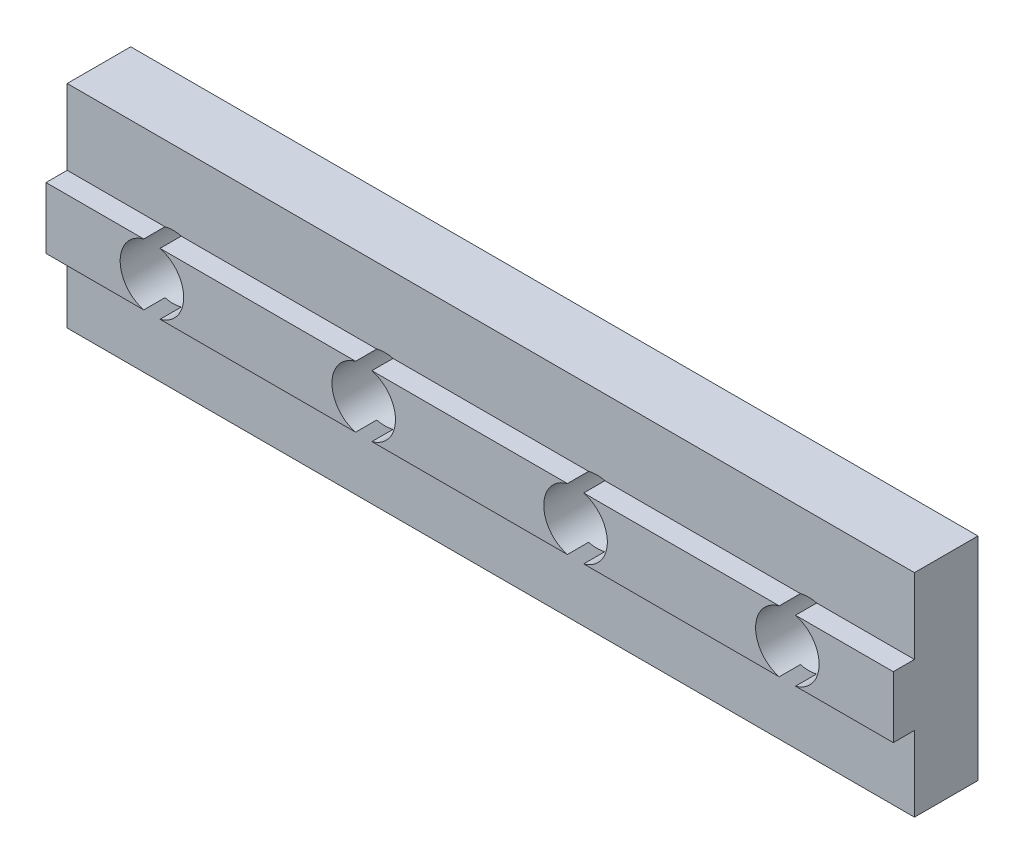
ISO-10303-21;
HEADER;
FILE_DESCRIPTION(('STEP AP214'),'2;1');
FILE_NAME('part.step','',(''),(''),'','','');
FILE_SCHEMA(('AUTOMOTIVE_DESIGN { 1 0 10303 214 1 1 1 1 }'));
ENDSEC;
DATA;
#1=APPLICATION_CONTEXT('core data for automotive mechanical design processes');
#2=APPLICATION_PROTOCOL_DEFINITION('international standard','automotive_design',2000,#1);
#3=PRODUCT_CONTEXT('',#1,'mechanical');
#4=PRODUCT('Part','Part','',(#3));
#5=PRODUCT_RELATED_PRODUCT_CATEGORY('part','',(#4));
#6=PRODUCT_DEFINITION_FORMATION('','',#4);
#7=PRODUCT_DEFINITION_CONTEXT('part definition',#1,'design');
#8=PRODUCT_DEFINITION('design','',#6,#7);
#9=PRODUCT_DEFINITION_SHAPE('','',#8);
#10=(LENGTH_UNIT() NAMED_UNIT(*) SI_UNIT(.MILLI.,.METRE.));
#11=(NAMED_UNIT(*) PLANE_ANGLE_UNIT() SI_UNIT($,.RADIAN.));
#12=(NAMED_UNIT(*) SI_UNIT($,.STERADIAN.) SOLID_ANGLE_UNIT());
#13=UNCERTAINTY_MEASURE_WITH_UNIT(LENGTH_MEASURE(1.E-05),#10,'distance_accuracy_value','');
#14=(GEOMETRIC_REPRESENTATION_CONTEXT(3) GLOBAL_UNCERTAINTY_ASSIGNED_CONTEXT((#13)) GLOBAL_UNIT_ASSIGNED_CONTEXT((#10,
#11,#12)) REPRESENTATION_CONTEXT('',''));
#15=CARTESIAN_POINT('',(0.,0.,0.));
#16=DIRECTION('',(0.,0.,1.));
#17=DIRECTION('',(1.,0.,0.));
#18=AXIS2_PLACEMENT_3D('',#15,#16,#17);
#19=CARTESIAN_POINT('',(40.,6.45000000000001,4.));
#20=DIRECTION('',(0.,-1.,0.));
#21=DIRECTION('',(1.,0.,0.));
#22=AXIS2_PLACEMENT_3D('',#19,#20,#21);
#23=PLANE('',#22);
#24=DIRECTION('',(-1.,0.,0.));
#25=VECTOR('',#24,1.);
#26=CARTESIAN_POINT('',(40.,6.45000000000001,4.));
#27=LINE('',#26,#25);
#28=CARTESIAN_POINT('',(14.6159427126066,6.45,4.));
#29=VERTEX_POINT('',#28);
#30=CARTESIAN_POINT('',(5.38405728739345,6.45,4.));
#31=VERTEX_POINT('',#30);
#32=EDGE_CURVE('E216',#29,#31,#27,.T.);
#33=ORIENTED_EDGE('',*,*,#32,.F.);
#34=DIRECTION('',(0.,0.,-1.));
#35=VECTOR('',#34,1.);
#36=CARTESIAN_POINT('',(14.6159427126066,6.45,4.));
#37=LINE('',#36,#35);
#38=CARTESIAN_POINT('',(14.6159427126066,6.45,3.));
#39=VERTEX_POINT('',#38);
#40=EDGE_CURVE('E257',#29,#39,#37,.T.);
#41=ORIENTED_EDGE('',*,*,#40,.T.);
#42=DIRECTION('',(-1.,0.,0.));
#43=VECTOR('',#42,1.);
#44=CARTESIAN_POINT('',(40.,6.45000000000001,3.));
#45=LINE('',#44,#43);
#46=CARTESIAN_POINT('',(5.38405728739345,6.45,3.));
#47=VERTEX_POINT('',#46);
#48=EDGE_CURVE('E304',#39,#47,#45,.T.);
#49=ORIENTED_EDGE('',*,*,#48,.T.);
#50=DIRECTION('',(0.,0.,-1.));
#51=VECTOR('',#50,1.);
#52=CARTESIAN_POINT('',(5.38405728739345,6.45,4.));
#53=LINE('',#52,#51);
#54=EDGE_CURVE('E200',#47,#31,#53,.F.);
#55=ORIENTED_EDGE('',*,*,#54,.T.);
#56=EDGE_LOOP('',(#33,#41,#49,#55));
#57=FACE_BOUND('',#56,.T.);
#58=ADVANCED_FACE('F33',(#57),#23,.F.);
#59=CARTESIAN_POINT('',(4.61594271260656,6.45,4.));
#60=VERTEX_POINT('',#59);
#61=CARTESIAN_POINT('',(0.,6.45,4.));
#62=VERTEX_POINT('',#61);
#63=EDGE_CURVE('E205',#60,#62,#27,.T.);
#64=ORIENTED_EDGE('',*,*,#63,.F.);
#65=DIRECTION('',(0.,0.,-1.));
#66=VECTOR('',#65,1.);
#67=CARTESIAN_POINT('',(4.61594271260656,6.45,4.));
#68=LINE('',#67,#66);
#69=CARTESIAN_POINT('',(4.61594271260656,6.45,3.));
#70=VERTEX_POINT('',#69);
#71=EDGE_CURVE('E192',#60,#70,#68,.T.);
#72=ORIENTED_EDGE('',*,*,#71,.T.);
#73=CARTESIAN_POINT('',(0.,6.45,3.));
#74=VERTEX_POINT('',#73);
#75=EDGE_CURVE('E300',#70,#74,#45,.T.);
#76=ORIENTED_EDGE('',*,*,#75,.T.);
#77=DIRECTION('',(0.,0.,-1.));
#78=VECTOR('',#77,1.);
#79=CARTESIAN_POINT('',(0.,6.45,4.));
#80=LINE('',#79,#78);
#81=EDGE_CURVE('E214',#62,#74,#80,.T.);
#82=ORIENTED_EDGE('',*,*,#81,.F.);
#83=EDGE_LOOP('',(#64,#72,#76,#82));
#84=FACE_BOUND('',#83,.T.);
#85=ADVANCED_FACE('F212',(#84),#23,.F.);
#86=CARTESIAN_POINT('',(0.,0.,4.));
#87=DIRECTION('',(0.,0.,1.));
#88=DIRECTION('',(1.,0.,0.));
#89=AXIS2_PLACEMENT_3D('',#86,#87,#88);
#90=PLANE('',#89);
#91=CARTESIAN_POINT('',(15.,5.,4.));
#92=DIRECTION('',(0.,0.,-1.));
#93=DIRECTION('',(-1.,0.,0.));
#94=AXIS2_PLACEMENT_3D('',#91,#92,#93);
#95=CIRCLE('',#94,1.5);
#96=CARTESIAN_POINT('',(14.6159427126066,3.55,4.));
#97=VERTEX_POINT('',#96);
#98=EDGE_CURVE('E48',#97,#29,#95,.T.);
#99=ORIENTED_EDGE('',*,*,#98,.T.);
#100=ORIENTED_EDGE('',*,*,#32,.T.);
#101=CARTESIAN_POINT('',(5.,5.,4.));
#102=DIRECTION('',(0.,0.,-1.));
#103=DIRECTION('',(-1.,0.,0.));
#104=AXIS2_PLACEMENT_3D('',#101,#102,#103);
#105=CIRCLE('',#104,1.5);
#106=CARTESIAN_POINT('',(5.38405728739345,3.55,4.));
#107=VERTEX_POINT('',#106);
#108=EDGE_CURVE('E209',#31,#107,#105,.T.);
#109=ORIENTED_EDGE('',*,*,#108,.T.);
#110=DIRECTION('',(1.,0.,0.));
#111=VECTOR('',#110,1.);
#112=CARTESIAN_POINT('',(40.,3.55000000000001,4.));
#113=LINE('',#112,#111);
#114=EDGE_CURVE('E334',#107,#97,#113,.T.);
#115=ORIENTED_EDGE('',*,*,#114,.T.);
#116=EDGE_LOOP('',(#99,#100,#109,#115));
#117=FACE_BOUND('',#116,.T.);
#118=ADVANCED_FACE('F420',(#117),#90,.T.);
#119=CARTESIAN_POINT('',(4.61594271260655,3.55,4.));
#120=VERTEX_POINT('',#119);
#121=EDGE_CURVE('E56',#120,#60,#105,.T.);
#122=ORIENTED_EDGE('',*,*,#121,.T.);
#123=ORIENTED_EDGE('',*,*,#63,.T.);
#124=DIRECTION('',(0.,-1.,0.));
#125=VECTOR('',#124,1.);
#126=CARTESIAN_POINT('',(0.,3.55,4.));
#127=LINE('',#126,#125);
#128=CARTESIAN_POINT('',(0.,3.55,4.));
#129=VERTEX_POINT('',#128);
#130=EDGE_CURVE('E227',#62,#129,#127,.T.);
#131=ORIENTED_EDGE('',*,*,#130,.T.);
#132=EDGE_CURVE('E208',#129,#120,#113,.T.);
#133=ORIENTED_EDGE('',*,*,#132,.T.);
#134=EDGE_LOOP('',(#122,#123,#131,#133));
#135=FACE_BOUND('',#134,.T.);
#136=ADVANCED_FACE('F204',(#135),#90,.T.);
#137=CARTESIAN_POINT('',(40.,3.55000000000001,4.));
#138=DIRECTION('',(0.,1.,0.));
#139=DIRECTION('',(-1.,0.,0.));
#140=AXIS2_PLACEMENT_3D('',#137,#138,#139);
#141=PLANE('',#140);
#142=CARTESIAN_POINT('',(15.3840572873935,3.55,4.));
#143=VERTEX_POINT('',#142);
#144=CARTESIAN_POINT('',(24.6159427126065,3.55,4.));
#145=VERTEX_POINT('',#144);
#146=EDGE_CURVE('E333',#143,#145,#113,.T.);
#147=ORIENTED_EDGE('',*,*,#146,.F.);
#148=DIRECTION('',(0.,0.,-1.));
#149=VECTOR('',#148,1.);
#150=CARTESIAN_POINT('',(15.3840572873935,3.55,4.));
#151=LINE('',#150,#149);
#152=CARTESIAN_POINT('',(15.3840572873935,3.55,3.));
#153=VERTEX_POINT('',#152);
#154=EDGE_CURVE('E11',#143,#153,#151,.T.);
#155=ORIENTED_EDGE('',*,*,#154,.T.);
#156=DIRECTION('',(1.,0.,0.));
#157=VECTOR('',#156,1.);
#158=CARTESIAN_POINT('',(40.,3.55000000000001,3.));
#159=LINE('',#158,#157);
#160=CARTESIAN_POINT('',(24.6159427126065,3.55,3.));
#161=VERTEX_POINT('',#160);
#162=EDGE_CURVE('E407',#153,#161,#159,.T.);
#163=ORIENTED_EDGE('',*,*,#162,.T.);
#164=DIRECTION('',(0.,0.,-1.));
#165=VECTOR('',#164,1.);
#166=CARTESIAN_POINT('',(24.6159427126065,3.55,4.));
#167=LINE('',#166,#165);
#168=EDGE_CURVE('E388',#161,#145,#167,.F.);
#169=ORIENTED_EDGE('',*,*,#168,.T.);
#170=EDGE_LOOP('',(#147,#155,#163,#169));
#171=FACE_BOUND('',#170,.T.);
#172=ADVANCED_FACE('F455',(#171),#141,.F.);
#173=CARTESIAN_POINT('',(5.38405728739345,3.55,3.));
#174=VERTEX_POINT('',#173);
#175=CARTESIAN_POINT('',(14.6159427126066,3.55,3.));
#176=VERTEX_POINT('',#175);
#177=EDGE_CURVE('E400',#174,#176,#159,.T.);
#178=ORIENTED_EDGE('',*,*,#177,.T.);
#179=DIRECTION('',(0.,0.,-1.));
#180=VECTOR('',#179,1.);
#181=CARTESIAN_POINT('',(14.6159427126066,3.55,4.));
#182=LINE('',#181,#180);
#183=EDGE_CURVE('E41',#176,#97,#182,.F.);
#184=ORIENTED_EDGE('',*,*,#183,.T.);
#185=ORIENTED_EDGE('',*,*,#114,.F.);
#186=DIRECTION('',(0.,0.,-1.));
#187=VECTOR('',#186,1.);
#188=CARTESIAN_POINT('',(5.38405728739345,3.55,4.));
#189=LINE('',#188,#187);
#190=EDGE_CURVE('E394',#107,#174,#189,.T.);
#191=ORIENTED_EDGE('',*,*,#190,.T.);
#192=EDGE_LOOP('',(#178,#184,#185,#191));
#193=FACE_BOUND('',#192,.T.);
#194=ADVANCED_FACE('F398',(#193),#141,.F.);
#195=CARTESIAN_POINT('',(24.6159427126066,6.45000000000001,3.));
#196=VERTEX_POINT('',#195);
#197=CARTESIAN_POINT('',(15.3840572873934,6.45,3.));
#198=VERTEX_POINT('',#197);
#199=EDGE_CURVE('E255',#196,#198,#45,.T.);
#200=ORIENTED_EDGE('',*,*,#199,.T.);
#201=DIRECTION('',(0.,0.,-1.));
#202=VECTOR('',#201,1.);
#203=CARTESIAN_POINT('',(15.3840572873934,6.45,4.));
#204=LINE('',#203,#202);
#205=CARTESIAN_POINT('',(15.3840572873934,6.45,4.));
#206=VERTEX_POINT('',#205);
#207=EDGE_CURVE('E254',#198,#206,#204,.F.);
#208=ORIENTED_EDGE('',*,*,#207,.T.);
#209=CARTESIAN_POINT('',(24.6159427126066,6.45000000000001,4.));
#210=VERTEX_POINT('',#209);
#211=EDGE_CURVE('E221',#210,#206,#27,.T.);
#212=ORIENTED_EDGE('',*,*,#211,.F.);
#213=DIRECTION('',(0.,0.,-1.));
#214=VECTOR('',#213,1.);
#215=CARTESIAN_POINT('',(24.6159427126066,6.45000000000001,4.));
#216=LINE('',#215,#214);
#217=EDGE_CURVE('E252',#210,#196,#216,.T.);
#218=ORIENTED_EDGE('',*,*,#217,.T.);
#219=EDGE_LOOP('',(#200,#208,#212,#218));
#220=FACE_BOUND('',#219,.T.);
#221=ADVANCED_FACE('F251',(#220),#23,.F.);
#222=EDGE_CURVE('E243',#206,#143,#95,.T.);
#223=ORIENTED_EDGE('',*,*,#222,.T.);
#224=ORIENTED_EDGE('',*,*,#146,.T.);
#225=CARTESIAN_POINT('',(25.,5.,4.));
#226=DIRECTION('',(0.,0.,-1.));
#227=DIRECTION('',(-1.,0.,0.));
#228=AXIS2_PLACEMENT_3D('',#225,#226,#227);
#229=CIRCLE('',#228,1.5);
#230=EDGE_CURVE('E246',#145,#210,#229,.T.);
#231=ORIENTED_EDGE('',*,*,#230,.T.);
#232=ORIENTED_EDGE('',*,*,#211,.T.);
#233=EDGE_LOOP('',(#223,#224,#231,#232));
#234=FACE_BOUND('',#233,.T.);
#235=ADVANCED_FACE('F242',(#234),#90,.T.);
#236=CARTESIAN_POINT('',(25.3840572873935,3.55,4.));
#237=VERTEX_POINT('',#236);
#238=CARTESIAN_POINT('',(34.6159427126065,3.55,4.));
#239=VERTEX_POINT('',#238);
#240=EDGE_CURVE('E327',#237,#239,#113,.T.);
#241=ORIENTED_EDGE('',*,*,#240,.F.);
#242=DIRECTION('',(0.,0.,-1.));
#243=VECTOR('',#242,1.);
#244=CARTESIAN_POINT('',(25.3840572873935,3.55,4.));
#245=LINE('',#244,#243);
#246=CARTESIAN_POINT('',(25.3840572873935,3.55,3.));
#247=VERTEX_POINT('',#246);
#248=EDGE_CURVE('E324',#237,#247,#245,.T.);
#249=ORIENTED_EDGE('',*,*,#248,.T.);
#250=CARTESIAN_POINT('',(34.6159427126065,3.55,3.));
#251=VERTEX_POINT('',#250);
#252=EDGE_CURVE('E316',#247,#251,#159,.T.);
#253=ORIENTED_EDGE('',*,*,#252,.T.);
#254=DIRECTION('',(0.,0.,-1.));
#255=VECTOR('',#254,1.);
#256=CARTESIAN_POINT('',(34.6159427126065,3.55,4.));
#257=LINE('',#256,#255);
#258=EDGE_CURVE('E283',#251,#239,#257,.F.);
#259=ORIENTED_EDGE('',*,*,#258,.T.);
#260=EDGE_LOOP('',(#241,#249,#253,#259));
#261=FACE_BOUND('',#260,.T.);
#262=ADVANCED_FACE('F330',(#261),#141,.F.);
#263=CARTESIAN_POINT('',(34.6159427126066,6.45000000000001,3.));
#264=VERTEX_POINT('',#263);
#265=CARTESIAN_POINT('',(25.3840572873934,6.45000000000001,3.));
#266=VERTEX_POINT('',#265);
#267=EDGE_CURVE('E313',#264,#266,#45,.T.);
#268=ORIENTED_EDGE('',*,*,#267,.T.);
#269=DIRECTION('',(0.,0.,-1.));
#270=VECTOR('',#269,1.);
#271=CARTESIAN_POINT('',(25.3840572873934,6.45000000000001,4.));
#272=LINE('',#271,#270);
#273=CARTESIAN_POINT('',(25.3840572873934,6.45000000000001,4.));
#274=VERTEX_POINT('',#273);
#275=EDGE_CURVE('E276',#266,#274,#272,.F.);
#276=ORIENTED_EDGE('',*,*,#275,.T.);
#277=CARTESIAN_POINT('',(34.6159427126066,6.45000000000001,4.));
#278=VERTEX_POINT('',#277);
#279=EDGE_CURVE('E228',#278,#274,#27,.T.);
#280=ORIENTED_EDGE('',*,*,#279,.F.);
#281=DIRECTION('',(0.,0.,-1.));
#282=VECTOR('',#281,1.);
#283=CARTESIAN_POINT('',(34.6159427126066,6.45000000000001,4.));
#284=LINE('',#283,#282);
#285=EDGE_CURVE('E298',#278,#264,#284,.T.);
#286=ORIENTED_EDGE('',*,*,#285,.T.);
#287=EDGE_LOOP('',(#268,#276,#280,#286));
#288=FACE_BOUND('',#287,.T.);
#289=ADVANCED_FACE('F317',(#288),#23,.F.);
#290=CARTESIAN_POINT('',(35.3840572873935,3.55,4.));
#291=VERTEX_POINT('',#290);
#292=CARTESIAN_POINT('',(40.,3.55000000000001,4.));
#293=VERTEX_POINT('',#292);
#294=EDGE_CURVE('E231',#291,#293,#113,.T.);
#295=ORIENTED_EDGE('',*,*,#294,.F.);
#296=DIRECTION('',(0.,0.,-1.));
#297=VECTOR('',#296,1.);
#298=CARTESIAN_POINT('',(35.3840572873935,3.55,4.));
#299=LINE('',#298,#297);
#300=CARTESIAN_POINT('',(35.3840572873935,3.55,3.));
#301=VERTEX_POINT('',#300);
#302=EDGE_CURVE('E289',#291,#301,#299,.T.);
#303=ORIENTED_EDGE('',*,*,#302,.T.);
#304=CARTESIAN_POINT('',(40.,3.55,3.));
#305=VERTEX_POINT('',#304);
#306=EDGE_CURVE('E312',#301,#305,#159,.T.);
#307=ORIENTED_EDGE('',*,*,#306,.T.);
#308=DIRECTION('',(0.,0.,-1.));
#309=VECTOR('',#308,1.);
#310=CARTESIAN_POINT('',(40.,3.55000000000001,4.));
#311=LINE('',#310,#309);
#312=EDGE_CURVE('E339',#293,#305,#311,.T.);
#313=ORIENTED_EDGE('',*,*,#312,.F.);
#314=EDGE_LOOP('',(#295,#303,#307,#313));
#315=FACE_BOUND('',#314,.T.);
#316=ADVANCED_FACE('F440',(#315),#141,.F.);
#317=EDGE_CURVE('E267',#274,#237,#229,.T.);
#318=ORIENTED_EDGE('',*,*,#317,.T.);
#319=ORIENTED_EDGE('',*,*,#240,.T.);
#320=CARTESIAN_POINT('',(35.,5.,4.));
#321=DIRECTION('',(0.,0.,1.));
#322=DIRECTION('',(1.,0.,0.));
#323=AXIS2_PLACEMENT_3D('',#320,#321,#322);
#324=CIRCLE('',#323,1.5);
#325=EDGE_CURVE('E387',#278,#239,#324,.T.);
#326=ORIENTED_EDGE('',*,*,#325,.F.);
#327=ORIENTED_EDGE('',*,*,#279,.T.);
#328=EDGE_LOOP('',(#318,#319,#326,#327));
#329=FACE_BOUND('',#328,.T.);
#330=ADVANCED_FACE('F326',(#329),#90,.T.);
#331=CARTESIAN_POINT('',(0.,0.,3.));
#332=DIRECTION('',(0.,0.,-1.));
#333=DIRECTION('',(-1.,0.,0.));
#334=AXIS2_PLACEMENT_3D('',#331,#332,#333);
#335=PLANE('',#334);
#336=ORIENTED_EDGE('',*,*,#162,.F.);
#337=CARTESIAN_POINT('',(15.,5.,3.));
#338=DIRECTION('',(0.,0.,-1.));
#339=DIRECTION('',(-1.,0.,0.));
#340=AXIS2_PLACEMENT_3D('',#337,#338,#339);
#341=CIRCLE('',#340,1.5);
#342=EDGE_CURVE('E199',#153,#176,#341,.T.);
#343=ORIENTED_EDGE('',*,*,#342,.T.);
#344=ORIENTED_EDGE('',*,*,#177,.F.);
#345=CARTESIAN_POINT('',(5.,5.,3.));
#346=DIRECTION('',(0.,0.,-1.));
#347=DIRECTION('',(-1.,0.,0.));
#348=AXIS2_PLACEMENT_3D('',#345,#346,#347);
#349=CIRCLE('',#348,1.5);
#350=CARTESIAN_POINT('',(4.61594271260655,3.55,3.));
#351=VERTEX_POINT('',#350);
#352=EDGE_CURVE('E412',#174,#351,#349,.T.);
#353=ORIENTED_EDGE('',*,*,#352,.T.);
#354=CARTESIAN_POINT('',(0.,3.55,3.));
#355=VERTEX_POINT('',#354);
#356=EDGE_CURVE('E223',#355,#351,#159,.T.);
#357=ORIENTED_EDGE('',*,*,#356,.F.);
#358=DIRECTION('',(0.,-1.,0.));
#359=VECTOR('',#358,1.);
#360=CARTESIAN_POINT('',(0.,0.,3.));
#361=LINE('',#360,#359);
#362=CARTESIAN_POINT('',(0.,0.,3.));
#363=VERTEX_POINT('',#362);
#364=EDGE_CURVE('E357',#355,#363,#361,.T.);
#365=ORIENTED_EDGE('',*,*,#364,.T.);
#366=DIRECTION('',(1.,0.,0.));
#367=VECTOR('',#366,1.);
#368=CARTESIAN_POINT('',(0.,0.,3.));
#369=LINE('',#368,#367);
#370=CARTESIAN_POINT('',(40.,0.,3.));
#371=VERTEX_POINT('',#370);
#372=EDGE_CURVE('E356',#363,#371,#369,.T.);
#373=ORIENTED_EDGE('',*,*,#372,.T.);
#374=DIRECTION('',(0.,1.,0.));
#375=VECTOR('',#374,1.);
#376=CARTESIAN_POINT('',(40.,0.,3.));
#377=LINE('',#376,#375);
#378=EDGE_CURVE('E360',#371,#305,#377,.T.);
#379=ORIENTED_EDGE('',*,*,#378,.T.);
#380=ORIENTED_EDGE('',*,*,#306,.F.);
#381=CARTESIAN_POINT('',(35.,5.,3.));
#382=DIRECTION('',(0.,0.,-1.));
#383=DIRECTION('',(-1.,0.,0.));
#384=AXIS2_PLACEMENT_3D('',#381,#382,#383);
#385=CIRCLE('',#384,1.5);
#386=EDGE_CURVE('E286',#301,#251,#385,.T.);
#387=ORIENTED_EDGE('',*,*,#386,.T.);
#388=ORIENTED_EDGE('',*,*,#252,.F.);
#389=CARTESIAN_POINT('',(25.,5.,3.));
#390=DIRECTION('',(0.,0.,-1.));
#391=DIRECTION('',(-1.,0.,0.));
#392=AXIS2_PLACEMENT_3D('',#389,#390,#391);
#393=CIRCLE('',#392,1.5);
#394=EDGE_CURVE('E270',#247,#161,#393,.T.);
#395=ORIENTED_EDGE('',*,*,#394,.T.);
#396=EDGE_LOOP('',(#336,#343,#344,#353,#357,#365,#373,#379,#380,#387,#388,#395));
#397=FACE_BOUND('',#396,.T.);
#398=ADVANCED_FACE('F405',(#397),#335,.F.);
#399=ORIENTED_EDGE('',*,*,#48,.F.);
#400=CARTESIAN_POINT('',(15.,5.,3.));
#401=DIRECTION('',(0.,0.,-1.));
#402=DIRECTION('',(-1.,0.,0.));
#403=AXIS2_PLACEMENT_3D('',#400,#401,#402);
#404=CIRCLE('',#403,1.5);
#405=EDGE_CURVE('E258',#39,#198,#404,.T.);
#406=ORIENTED_EDGE('',*,*,#405,.T.);
#407=ORIENTED_EDGE('',*,*,#199,.F.);
#408=CARTESIAN_POINT('',(25.,5.,3.));
#409=DIRECTION('',(0.,0.,-1.));
#410=DIRECTION('',(-1.,0.,0.));
#411=AXIS2_PLACEMENT_3D('',#408,#409,#410);
#412=CIRCLE('',#411,1.5);
#413=EDGE_CURVE('E273',#196,#266,#412,.T.);
#414=ORIENTED_EDGE('',*,*,#413,.T.);
#415=ORIENTED_EDGE('',*,*,#267,.F.);
#416=CARTESIAN_POINT('',(35.,5.,3.));
#417=DIRECTION('',(0.,0.,-1.));
#418=DIRECTION('',(-1.,0.,0.));
#419=AXIS2_PLACEMENT_3D('',#416,#417,#418);
#420=CIRCLE('',#419,1.5);
#421=CARTESIAN_POINT('',(35.3840572873934,6.45000000000001,3.));
#422=VERTEX_POINT('',#421);
#423=EDGE_CURVE('E295',#264,#422,#420,.T.);
#424=ORIENTED_EDGE('',*,*,#423,.T.);
#425=CARTESIAN_POINT('',(40.,6.45,3.));
#426=VERTEX_POINT('',#425);
#427=EDGE_CURVE('E306',#426,#422,#45,.T.);
#428=ORIENTED_EDGE('',*,*,#427,.F.);
#429=CARTESIAN_POINT('',(40.,10.,3.));
#430=VERTEX_POINT('',#429);
#431=EDGE_CURVE('E359',#426,#430,#377,.T.);
#432=ORIENTED_EDGE('',*,*,#431,.T.);
#433=DIRECTION('',(-1.,0.,0.));
#434=VECTOR('',#433,1.);
#435=CARTESIAN_POINT('',(0.,10.,3.));
#436=LINE('',#435,#434);
#437=CARTESIAN_POINT('',(0.,10.,3.));
#438=VERTEX_POINT('',#437);
#439=EDGE_CURVE('E363',#430,#438,#436,.T.);
#440=ORIENTED_EDGE('',*,*,#439,.T.);
#441=EDGE_CURVE('E354',#438,#74,#361,.T.);
#442=ORIENTED_EDGE('',*,*,#441,.T.);
#443=ORIENTED_EDGE('',*,*,#75,.F.);
#444=CARTESIAN_POINT('',(5.,5.,3.));
#445=DIRECTION('',(0.,0.,-1.));
#446=DIRECTION('',(-1.,0.,0.));
#447=AXIS2_PLACEMENT_3D('',#444,#445,#446);
#448=CIRCLE('',#447,1.5);
#449=EDGE_CURVE('E195',#70,#47,#448,.T.);
#450=ORIENTED_EDGE('',*,*,#449,.T.);
#451=EDGE_LOOP('',(#399,#406,#407,#414,#415,#424,#428,#432,#440,#442,#443,#450));
#452=FACE_BOUND('',#451,.T.);
#453=ADVANCED_FACE('F320',(#452),#335,.F.);
#454=CARTESIAN_POINT('',(0.,0.,3.));
#455=DIRECTION('',(1.,0.,0.));
#456=DIRECTION('',(0.,0.,-1.));
#457=AXIS2_PLACEMENT_3D('',#454,#455,#456);
#458=PLANE('',#457);
#459=DIRECTION('',(0.,-1.,0.));
#460=VECTOR('',#459,1.);
#461=CARTESIAN_POINT('',(0.,0.,0.));
#462=LINE('',#461,#460);
#463=CARTESIAN_POINT('',(0.,10.,0.));
#464=VERTEX_POINT('',#463);
#465=CARTESIAN_POINT('',(0.,0.,0.));
#466=VERTEX_POINT('',#465);
#467=EDGE_CURVE('E353',#464,#466,#462,.T.);
#468=ORIENTED_EDGE('',*,*,#467,.T.);
#469=DIRECTION('',(0.,0.,-1.));
#470=VECTOR('',#469,1.);
#471=CARTESIAN_POINT('',(0.,0.,3.));
#472=LINE('',#471,#470);
#473=EDGE_CURVE('E382',#363,#466,#472,.T.);
#474=ORIENTED_EDGE('',*,*,#473,.F.);
#475=ORIENTED_EDGE('',*,*,#364,.F.);
#476=DIRECTION('',(0.,0.,-1.));
#477=VECTOR('',#476,1.);
#478=CARTESIAN_POINT('',(0.,3.55,4.));
#479=LINE('',#478,#477);
#480=EDGE_CURVE('E341',#129,#355,#479,.T.);
#481=ORIENTED_EDGE('',*,*,#480,.F.);
#482=ORIENTED_EDGE('',*,*,#130,.F.);
#483=ORIENTED_EDGE('',*,*,#81,.T.);
#484=ORIENTED_EDGE('',*,*,#441,.F.);
#485=DIRECTION('',(0.,0.,-1.));
#486=VECTOR('',#485,1.);
#487=CARTESIAN_POINT('',(0.,10.,3.));
#488=LINE('',#487,#486);
#489=EDGE_CURVE('E365',#438,#464,#488,.T.);
#490=ORIENTED_EDGE('',*,*,#489,.T.);
#491=EDGE_LOOP('',(#468,#474,#475,#481,#482,#483,#484,#490));
#492=FACE_BOUND('',#491,.T.);
#493=ADVANCED_FACE('F35',(#492),#458,.F.);
#494=CARTESIAN_POINT('',(0.,0.,3.));
#495=DIRECTION('',(0.,1.,0.));
#496=DIRECTION('',(0.,0.,1.));
#497=AXIS2_PLACEMENT_3D('',#494,#495,#496);
#498=PLANE('',#497);
#499=DIRECTION('',(1.,0.,0.));
#500=VECTOR('',#499,1.);
#501=CARTESIAN_POINT('',(0.,0.,0.));
#502=LINE('',#501,#500);
#503=CARTESIAN_POINT('',(40.,0.,0.));
#504=VERTEX_POINT('',#503);
#505=EDGE_CURVE('E368',#466,#504,#502,.T.);
#506=ORIENTED_EDGE('',*,*,#505,.T.);
#507=DIRECTION('',(0.,0.,-1.));
#508=VECTOR('',#507,1.);
#509=CARTESIAN_POINT('',(40.,0.,3.));
#510=LINE('',#509,#508);
#511=EDGE_CURVE('E379',#371,#504,#510,.T.);
#512=ORIENTED_EDGE('',*,*,#511,.F.);
#513=ORIENTED_EDGE('',*,*,#372,.F.);
#514=ORIENTED_EDGE('',*,*,#473,.T.);
#515=EDGE_LOOP('',(#506,#512,#513,#514));
#516=FACE_BOUND('',#515,.T.);
#517=ADVANCED_FACE('F497',(#516),#498,.F.);
#518=CARTESIAN_POINT('',(40.,0.,3.));
#519=DIRECTION('',(-1.,0.,0.));
#520=DIRECTION('',(0.,0.,1.));
#521=AXIS2_PLACEMENT_3D('',#518,#519,#520);
#522=PLANE('',#521);
#523=DIRECTION('',(0.,1.,0.));
#524=VECTOR('',#523,1.);
#525=CARTESIAN_POINT('',(40.,0.,0.));
#526=LINE('',#525,#524);
#527=CARTESIAN_POINT('',(40.,10.,0.));
#528=VERTEX_POINT('',#527);
#529=EDGE_CURVE('E370',#504,#528,#526,.T.);
#530=ORIENTED_EDGE('',*,*,#529,.T.);
#531=DIRECTION('',(0.,0.,-1.));
#532=VECTOR('',#531,1.);
#533=CARTESIAN_POINT('',(40.,10.,3.));
#534=LINE('',#533,#532);
#535=EDGE_CURVE('E376',#430,#528,#534,.T.);
#536=ORIENTED_EDGE('',*,*,#535,.F.);
#537=ORIENTED_EDGE('',*,*,#431,.F.);
#538=DIRECTION('',(0.,0.,-1.));
#539=VECTOR('',#538,1.);
#540=CARTESIAN_POINT('',(40.,6.45000000000001,4.));
#541=LINE('',#540,#539);
#542=CARTESIAN_POINT('',(40.,6.45000000000001,4.));
#543=VERTEX_POINT('',#542);
#544=EDGE_CURVE('E351',#543,#426,#541,.T.);
#545=ORIENTED_EDGE('',*,*,#544,.F.);
#546=DIRECTION('',(0.,1.,0.));
#547=VECTOR('',#546,1.);
#548=CARTESIAN_POINT('',(40.,3.55000000000001,4.));
#549=LINE('',#548,#547);
#550=EDGE_CURVE('E217',#293,#543,#549,.T.);
#551=ORIENTED_EDGE('',*,*,#550,.F.);
#552=ORIENTED_EDGE('',*,*,#312,.T.);
#553=ORIENTED_EDGE('',*,*,#378,.F.);
#554=ORIENTED_EDGE('',*,*,#511,.T.);
#555=EDGE_LOOP('',(#530,#536,#537,#545,#551,#552,#553,#554));
#556=FACE_BOUND('',#555,.T.);
#557=ADVANCED_FACE('F444',(#556),#522,.F.);
#558=CARTESIAN_POINT('',(0.,10.,3.));
#559=DIRECTION('',(0.,-1.,0.));
#560=DIRECTION('',(0.,0.,-1.));
#561=AXIS2_PLACEMENT_3D('',#558,#559,#560);
#562=PLANE('',#561);
#563=DIRECTION('',(-1.,0.,0.));
#564=VECTOR('',#563,1.);
#565=CARTESIAN_POINT('',(0.,10.,0.));
#566=LINE('',#565,#564);
#567=EDGE_CURVE('E372',#528,#464,#566,.T.);
#568=ORIENTED_EDGE('',*,*,#567,.T.);
#569=ORIENTED_EDGE('',*,*,#489,.F.);
#570=ORIENTED_EDGE('',*,*,#439,.F.);
#571=ORIENTED_EDGE('',*,*,#535,.T.);
#572=EDGE_LOOP('',(#568,#569,#570,#571));
#573=FACE_BOUND('',#572,.T.);
#574=ADVANCED_FACE('F456',(#573),#562,.F.);
#575=CARTESIAN_POINT('',(0.,0.,0.));
#576=DIRECTION('',(0.,0.,-1.));
#577=DIRECTION('',(-1.,0.,0.));
#578=AXIS2_PLACEMENT_3D('',#575,#576,#577);
#579=PLANE('',#578);
#580=CARTESIAN_POINT('',(15.,5.,0.));
#581=DIRECTION('',(0.,0.,-1.));
#582=DIRECTION('',(-1.,0.,0.));
#583=AXIS2_PLACEMENT_3D('',#580,#581,#582);
#584=CIRCLE('',#583,1.5);
#585=CARTESIAN_POINT('',(13.5,5.,0.));
#586=VERTEX_POINT('',#585);
#587=EDGE_CURVE('E416',#586,#586,#584,.T.);
#588=ORIENTED_EDGE('',*,*,#587,.F.);
#589=EDGE_LOOP('',(#588));
#590=FACE_BOUND('',#589,.T.);
#591=CARTESIAN_POINT('',(5.,5.,0.));
#592=DIRECTION('',(0.,0.,-1.));
#593=DIRECTION('',(-1.,0.,0.));
#594=AXIS2_PLACEMENT_3D('',#591,#592,#593);
#595=CIRCLE('',#594,1.5);
#596=CARTESIAN_POINT('',(3.5,5.,0.));
#597=VERTEX_POINT('',#596);
#598=EDGE_CURVE('E210',#597,#597,#595,.T.);
#599=ORIENTED_EDGE('',*,*,#598,.F.);
#600=EDGE_LOOP('',(#599));
#601=FACE_BOUND('',#600,.T.);
#602=CARTESIAN_POINT('',(25.,5.,0.));
#603=DIRECTION('',(0.,0.,-1.));
#604=DIRECTION('',(-1.,0.,0.));
#605=AXIS2_PLACEMENT_3D('',#602,#603,#604);
#606=CIRCLE('',#605,1.5);
#607=CARTESIAN_POINT('',(23.5,5.,0.));
#608=VERTEX_POINT('',#607);
#609=EDGE_CURVE('E261',#608,#608,#606,.T.);
#610=ORIENTED_EDGE('',*,*,#609,.F.);
#611=EDGE_LOOP('',(#610));
#612=FACE_BOUND('',#611,.T.);
#613=CARTESIAN_POINT('',(35.,5.,0.));
#614=DIRECTION('',(0.,0.,-1.));
#615=DIRECTION('',(-1.,0.,0.));
#616=AXIS2_PLACEMENT_3D('',#613,#614,#615);
#617=CIRCLE('',#616,1.5);
#618=CARTESIAN_POINT('',(33.5,5.,0.));
#619=VERTEX_POINT('',#618);
#620=EDGE_CURVE('E280',#619,#619,#617,.T.);
#621=ORIENTED_EDGE('',*,*,#620,.F.);
#622=EDGE_LOOP('',(#621));
#623=FACE_BOUND('',#622,.T.);
#624=ORIENTED_EDGE('',*,*,#467,.F.);
#625=ORIENTED_EDGE('',*,*,#567,.F.);
#626=ORIENTED_EDGE('',*,*,#529,.F.);
#627=ORIENTED_EDGE('',*,*,#505,.F.);
#628=EDGE_LOOP('',(#624,#625,#626,#627));
#629=FACE_BOUND('',#628,.T.);
#630=ADVANCED_FACE('F448',(#590,#601,#612,#623,#629),#579,.T.);
#631=ORIENTED_EDGE('',*,*,#427,.T.);
#632=DIRECTION('',(0.,0.,-1.));
#633=VECTOR('',#632,1.);
#634=CARTESIAN_POINT('',(35.3840572873934,6.45000000000001,4.));
#635=LINE('',#634,#633);
#636=CARTESIAN_POINT('',(35.3840572873934,6.45000000000001,4.));
#637=VERTEX_POINT('',#636);
#638=EDGE_CURVE('E292',#422,#637,#635,.F.);
#639=ORIENTED_EDGE('',*,*,#638,.T.);
#640=EDGE_CURVE('E219',#543,#637,#27,.T.);
#641=ORIENTED_EDGE('',*,*,#640,.F.);
#642=ORIENTED_EDGE('',*,*,#544,.T.);
#643=EDGE_LOOP('',(#631,#639,#641,#642));
#644=FACE_BOUND('',#643,.T.);
#645=ADVANCED_FACE('F446',(#644),#23,.F.);
#646=ORIENTED_EDGE('',*,*,#356,.T.);
#647=DIRECTION('',(0.,0.,-1.));
#648=VECTOR('',#647,1.);
#649=CARTESIAN_POINT('',(4.61594271260655,3.55,4.));
#650=LINE('',#649,#648);
#651=EDGE_CURVE('E392',#351,#120,#650,.F.);
#652=ORIENTED_EDGE('',*,*,#651,.T.);
#653=ORIENTED_EDGE('',*,*,#132,.F.);
#654=ORIENTED_EDGE('',*,*,#480,.T.);
#655=EDGE_LOOP('',(#646,#652,#653,#654));
#656=FACE_BOUND('',#655,.T.);
#657=ADVANCED_FACE('F431',(#656),#141,.F.);
#658=EDGE_CURVE('E385',#291,#637,#324,.T.);
#659=ORIENTED_EDGE('',*,*,#658,.F.);
#660=ORIENTED_EDGE('',*,*,#294,.T.);
#661=ORIENTED_EDGE('',*,*,#550,.T.);
#662=ORIENTED_EDGE('',*,*,#640,.T.);
#663=EDGE_LOOP('',(#659,#660,#661,#662));
#664=FACE_BOUND('',#663,.T.);
#665=ADVANCED_FACE('F441',(#664),#90,.T.);
#666=CARTESIAN_POINT('',(35.,5.,4.));
#667=DIRECTION('',(0.,0.,-1.));
#668=DIRECTION('',(-1.,0.,0.));
#669=AXIS2_PLACEMENT_3D('',#666,#667,#668);
#670=CYLINDRICAL_SURFACE('',#669,1.5);
#671=ORIENTED_EDGE('',*,*,#620,.T.);
#672=EDGE_LOOP('',(#671));
#673=FACE_BOUND('',#672,.T.);
#674=ORIENTED_EDGE('',*,*,#325,.T.);
#675=ORIENTED_EDGE('',*,*,#258,.F.);
#676=ORIENTED_EDGE('',*,*,#386,.F.);
#677=ORIENTED_EDGE('',*,*,#302,.F.);
#678=ORIENTED_EDGE('',*,*,#658,.T.);
#679=ORIENTED_EDGE('',*,*,#638,.F.);
#680=ORIENTED_EDGE('',*,*,#423,.F.);
#681=ORIENTED_EDGE('',*,*,#285,.F.);
#682=EDGE_LOOP('',(#674,#675,#676,#677,#678,#679,#680,#681));
#683=FACE_BOUND('',#682,.T.);
#684=ADVANCED_FACE('F436',(#673,#683),#670,.F.);
#685=CARTESIAN_POINT('',(25.,5.,4.));
#686=DIRECTION('',(0.,0.,-1.));
#687=DIRECTION('',(-1.,0.,0.));
#688=AXIS2_PLACEMENT_3D('',#685,#686,#687);
#689=CYLINDRICAL_SURFACE('',#688,1.5);
#690=ORIENTED_EDGE('',*,*,#609,.T.);
#691=EDGE_LOOP('',(#690));
#692=FACE_BOUND('',#691,.T.);
#693=ORIENTED_EDGE('',*,*,#230,.F.);
#694=ORIENTED_EDGE('',*,*,#168,.F.);
#695=ORIENTED_EDGE('',*,*,#394,.F.);
#696=ORIENTED_EDGE('',*,*,#248,.F.);
#697=ORIENTED_EDGE('',*,*,#317,.F.);
#698=ORIENTED_EDGE('',*,*,#275,.F.);
#699=ORIENTED_EDGE('',*,*,#413,.F.);
#700=ORIENTED_EDGE('',*,*,#217,.F.);
#701=EDGE_LOOP('',(#693,#694,#695,#696,#697,#698,#699,#700));
#702=FACE_BOUND('',#701,.T.);
#703=ADVANCED_FACE('F322',(#692,#702),#689,.F.);
#704=CARTESIAN_POINT('',(5.,5.,4.));
#705=DIRECTION('',(0.,0.,-1.));
#706=DIRECTION('',(-1.,0.,0.));
#707=AXIS2_PLACEMENT_3D('',#704,#705,#706);
#708=CYLINDRICAL_SURFACE('',#707,1.5);
#709=ORIENTED_EDGE('',*,*,#598,.T.);
#710=EDGE_LOOP('',(#709));
#711=FACE_BOUND('',#710,.T.);
#712=ORIENTED_EDGE('',*,*,#121,.F.);
#713=ORIENTED_EDGE('',*,*,#651,.F.);
#714=ORIENTED_EDGE('',*,*,#352,.F.);
#715=ORIENTED_EDGE('',*,*,#190,.F.);
#716=ORIENTED_EDGE('',*,*,#108,.F.);
#717=ORIENTED_EDGE('',*,*,#54,.F.);
#718=ORIENTED_EDGE('',*,*,#449,.F.);
#719=ORIENTED_EDGE('',*,*,#71,.F.);
#720=EDGE_LOOP('',(#712,#713,#714,#715,#716,#717,#718,#719));
#721=FACE_BOUND('',#720,.T.);
#722=ADVANCED_FACE('F193',(#711,#721),#708,.F.);
#723=CARTESIAN_POINT('',(15.,5.,4.));
#724=DIRECTION('',(0.,0.,-1.));
#725=DIRECTION('',(-1.,0.,0.));
#726=AXIS2_PLACEMENT_3D('',#723,#724,#725);
#727=CYLINDRICAL_SURFACE('',#726,1.5);
#728=ORIENTED_EDGE('',*,*,#587,.T.);
#729=EDGE_LOOP('',(#728));
#730=FACE_BOUND('',#729,.T.);
#731=ORIENTED_EDGE('',*,*,#98,.F.);
#732=ORIENTED_EDGE('',*,*,#183,.F.);
#733=ORIENTED_EDGE('',*,*,#342,.F.);
#734=ORIENTED_EDGE('',*,*,#154,.F.);
#735=ORIENTED_EDGE('',*,*,#222,.F.);
#736=ORIENTED_EDGE('',*,*,#207,.F.);
#737=ORIENTED_EDGE('',*,*,#405,.F.);
#738=ORIENTED_EDGE('',*,*,#40,.F.);
#739=EDGE_LOOP('',(#731,#732,#733,#734,#735,#736,#737,#738));
#740=FACE_BOUND('',#739,.T.);
#741=ADVANCED_FACE('F402',(#730,#740),#727,.F.);
#742=CLOSED_SHELL('',(#58,#85,#118,#136,#172,#194,#221,#235,#262,#289,#316,#330,#398,#453,#493,
#517,#557,#574,#630,#645,#657,#665,#684,#703,#722,#741));
#743=MANIFOLD_SOLID_BREP('B2',#742);
#744=ADVANCED_BREP_SHAPE_REPRESENTATION('',(#18,#743),#14);
#745=SHAPE_DEFINITION_REPRESENTATION(#9,#744);
ENDSEC;
END-ISO-10303-21;
